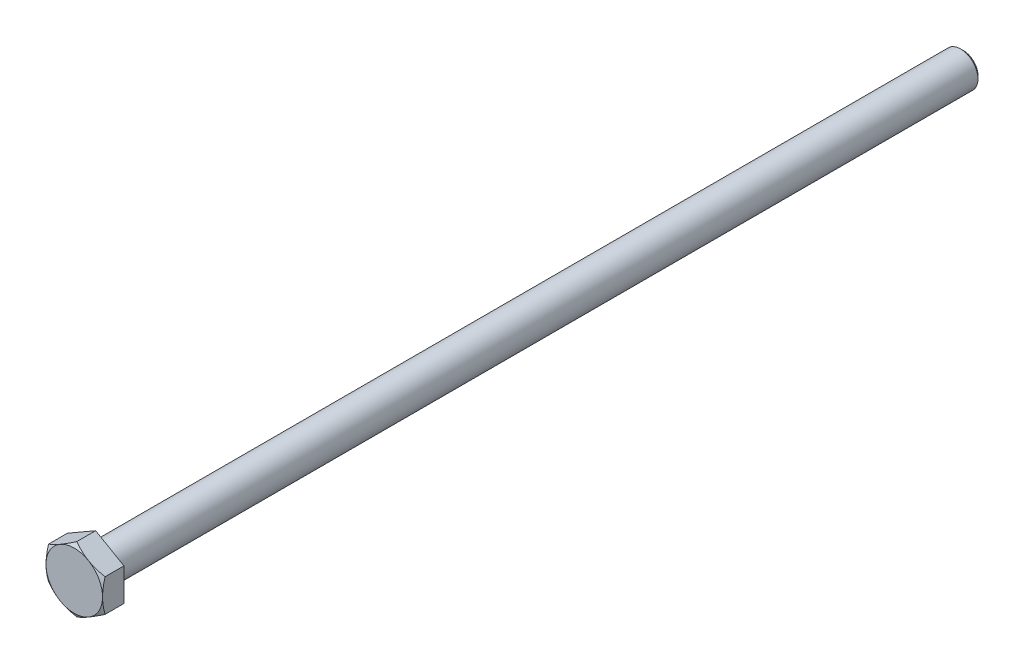
ISO-10303-21;
HEADER;
FILE_DESCRIPTION(('STEP AP214'),'2;1');
FILE_NAME('part.step','',(''),(''),'','','');
FILE_SCHEMA(('AUTOMOTIVE_DESIGN { 1 0 10303 214 1 1 1 1 }'));
ENDSEC;
DATA;
#1=APPLICATION_CONTEXT('core data for automotive mechanical design processes');
#2=APPLICATION_PROTOCOL_DEFINITION('international standard','automotive_design',2000,#1);
#3=PRODUCT_CONTEXT('',#1,'mechanical');
#4=PRODUCT('Part','Part','',(#3));
#5=PRODUCT_RELATED_PRODUCT_CATEGORY('part','',(#4));
#6=PRODUCT_DEFINITION_FORMATION('','',#4);
#7=PRODUCT_DEFINITION_CONTEXT('part definition',#1,'design');
#8=PRODUCT_DEFINITION('design','',#6,#7);
#9=PRODUCT_DEFINITION_SHAPE('','',#8);
#10=(LENGTH_UNIT() NAMED_UNIT(*) SI_UNIT(.MILLI.,.METRE.));
#11=(NAMED_UNIT(*) PLANE_ANGLE_UNIT() SI_UNIT($,.RADIAN.));
#12=(NAMED_UNIT(*) SI_UNIT($,.STERADIAN.) SOLID_ANGLE_UNIT());
#13=UNCERTAINTY_MEASURE_WITH_UNIT(LENGTH_MEASURE(1.E-05),#10,'distance_accuracy_value','');
#14=(GEOMETRIC_REPRESENTATION_CONTEXT(3) GLOBAL_UNCERTAINTY_ASSIGNED_CONTEXT((#13)) GLOBAL_UNIT_ASSIGNED_CONTEXT((#10,
#11,#12)) REPRESENTATION_CONTEXT('',''));
#15=CARTESIAN_POINT('',(0.,0.,0.));
#16=DIRECTION('',(0.,0.,1.));
#17=DIRECTION('',(1.,0.,0.));
#18=AXIS2_PLACEMENT_3D('',#15,#16,#17);
#19=CARTESIAN_POINT('',(0.,0.,0.));
#20=DIRECTION('',(0.,0.,1.));
#21=DIRECTION('',(1.,0.,0.));
#22=AXIS2_PLACEMENT_3D('',#19,#20,#21);
#23=PLANE('',#22);
#24=CARTESIAN_POINT('',(0.,0.,0.));
#25=DIRECTION('',(0.,0.,1.));
#26=DIRECTION('',(1.,0.,0.));
#27=AXIS2_PLACEMENT_3D('',#24,#25,#26);
#28=CIRCLE('',#27,3.25);
#29=CARTESIAN_POINT('',(3.25,0.,0.));
#30=VERTEX_POINT('',#29);
#31=EDGE_CURVE('E146',#30,#30,#28,.T.);
#32=ORIENTED_EDGE('',*,*,#31,.T.);
#33=EDGE_LOOP('',(#32));
#34=FACE_BOUND('',#33,.T.);
#35=CARTESIAN_POINT('',(0.,0.,0.));
#36=DIRECTION('',(0.,0.,1.));
#37=DIRECTION('',(1.,0.,0.));
#38=AXIS2_PLACEMENT_3D('',#35,#36,#37);
#39=CIRCLE('',#38,4.45);
#40=CARTESIAN_POINT('',(4.45,0.,0.));
#41=VERTEX_POINT('',#40);
#42=EDGE_CURVE('E292',#41,#41,#39,.T.);
#43=ORIENTED_EDGE('',*,*,#42,.F.);
#44=EDGE_LOOP('',(#43));
#45=FACE_BOUND('',#44,.T.);
#46=ADVANCED_FACE('F37',(#34,#45),#23,.F.);
#47=CARTESIAN_POINT('',(0.,0.,-0.25));
#48=DIRECTION('',(0.,0.,1.));
#49=DIRECTION('',(1.,0.,0.));
#50=AXIS2_PLACEMENT_3D('',#47,#48,#49);
#51=TOROIDAL_SURFACE('',#50,3.25,0.25);
#52=ORIENTED_EDGE('',*,*,#31,.F.);
#53=EDGE_LOOP('',(#52));
#54=FACE_BOUND('',#53,.T.);
#55=CARTESIAN_POINT('',(0.,0.,-0.25));
#56=DIRECTION('',(0.,0.,1.));
#57=DIRECTION('',(1.,0.,0.));
#58=AXIS2_PLACEMENT_3D('',#55,#56,#57);
#59=CIRCLE('',#58,3.);
#60=CARTESIAN_POINT('',(3.,0.,-0.25));
#61=VERTEX_POINT('',#60);
#62=EDGE_CURVE('E149',#61,#61,#59,.T.);
#63=ORIENTED_EDGE('',*,*,#62,.T.);
#64=EDGE_LOOP('',(#63));
#65=FACE_BOUND('',#64,.T.);
#66=ADVANCED_FACE('F233',(#54,#65),#51,.F.);
#67=CARTESIAN_POINT('',(0.,0.,0.));
#68=DIRECTION('',(0.,0.,1.));
#69=DIRECTION('',(1.,0.,0.));
#70=AXIS2_PLACEMENT_3D('',#67,#68,#69);
#71=CYLINDRICAL_SURFACE('',#70,3.00000000000001);
#72=ORIENTED_EDGE('',*,*,#62,.F.);
#73=EDGE_LOOP('',(#72));
#74=FACE_BOUND('',#73,.T.);
#75=CARTESIAN_POINT('',(0.,0.,-149.5));
#76=DIRECTION('',(0.,0.,1.));
#77=DIRECTION('',(1.,0.,0.));
#78=AXIS2_PLACEMENT_3D('',#75,#76,#77);
#79=CIRCLE('',#78,3.00000000000002);
#80=CARTESIAN_POINT('',(3.00000000000002,0.,-149.5));
#81=VERTEX_POINT('',#80);
#82=EDGE_CURVE('E152',#81,#81,#79,.T.);
#83=ORIENTED_EDGE('',*,*,#82,.T.);
#84=EDGE_LOOP('',(#83));
#85=FACE_BOUND('',#84,.T.);
#86=ADVANCED_FACE('F239',(#74,#85),#71,.T.);
#87=CARTESIAN_POINT('',(0.,0.,-150.));
#88=DIRECTION('',(0.,0.,1.));
#89=DIRECTION('',(1.,0.,0.));
#90=AXIS2_PLACEMENT_3D('',#87,#88,#89);
#91=CONICAL_SURFACE('',#90,2.5,0.785398163397497);
#92=ORIENTED_EDGE('',*,*,#82,.F.);
#93=EDGE_LOOP('',(#92));
#94=FACE_BOUND('',#93,.T.);
#95=CARTESIAN_POINT('',(0.,0.,-150.));
#96=DIRECTION('',(0.,0.,1.));
#97=DIRECTION('',(1.,0.,0.));
#98=AXIS2_PLACEMENT_3D('',#95,#96,#97);
#99=CIRCLE('',#98,2.5);
#100=CARTESIAN_POINT('',(2.5,0.,-150.));
#101=VERTEX_POINT('',#100);
#102=EDGE_CURVE('E125',#101,#101,#99,.T.);
#103=ORIENTED_EDGE('',*,*,#102,.T.);
#104=EDGE_LOOP('',(#103));
#105=FACE_BOUND('',#104,.T.);
#106=ADVANCED_FACE('F306',(#94,#105),#91,.T.);
#107=CARTESIAN_POINT('',(0.,2.5,-150.));
#108=DIRECTION('',(0.,0.,1.));
#109=DIRECTION('',(1.,0.,0.));
#110=AXIS2_PLACEMENT_3D('',#107,#108,#109);
#111=PLANE('',#110);
#112=ORIENTED_EDGE('',*,*,#102,.F.);
#113=EDGE_LOOP('',(#112));
#114=FACE_BOUND('',#113,.T.);
#115=ADVANCED_FACE('F302',(#114),#111,.F.);
#116=CARTESIAN_POINT('',(0.,5.64648563267455,0.149999999999995));
#117=DIRECTION('',(0.,0.,-1.));
#118=DIRECTION('',(-1.,0.,0.));
#119=AXIS2_PLACEMENT_3D('',#116,#117,#118);
#120=PLANE('',#119);
#121=CARTESIAN_POINT('',(0.,0.,0.149999999999996));
#122=DIRECTION('',(0.,0.,1.));
#123=DIRECTION('',(1.,0.,0.));
#124=AXIS2_PLACEMENT_3D('',#121,#122,#123);
#125=CIRCLE('',#124,4.53660254037844);
#126=CARTESIAN_POINT('',(4.53660254037844,0.,0.149999999999996));
#127=VERTEX_POINT('',#126);
#128=EDGE_CURVE('E289',#127,#127,#125,.T.);
#129=ORIENTED_EDGE('',*,*,#128,.T.);
#130=EDGE_LOOP('',(#129));
#131=FACE_BOUND('',#130,.T.);
#132=DIRECTION('',(0.866025403784439,-0.5,0.));
#133=VECTOR('',#132,1.);
#134=CARTESIAN_POINT('',(4.88999999999999,2.82324281633728,0.149999999999995));
#135=LINE('',#134,#133);
#136=CARTESIAN_POINT('',(0.,5.64648563267455,0.149999999999994));
#137=VERTEX_POINT('',#136);
#138=CARTESIAN_POINT('',(4.88999999999999,2.82324281633728,0.149999999999996));
#139=VERTEX_POINT('',#138);
#140=EDGE_CURVE('E60',#137,#139,#135,.T.);
#141=ORIENTED_EDGE('',*,*,#140,.T.);
#142=DIRECTION('',(0.,-1.,0.));
#143=VECTOR('',#142,1.);
#144=CARTESIAN_POINT('',(4.89,-2.82324281633726,0.149999999999995));
#145=LINE('',#144,#143);
#146=CARTESIAN_POINT('',(4.89,-2.8232428163373,0.149999999999994));
#147=VERTEX_POINT('',#146);
#148=EDGE_CURVE('E11',#139,#147,#145,.T.);
#149=ORIENTED_EDGE('',*,*,#148,.T.);
#150=DIRECTION('',(-0.866025403784439,-0.5,0.));
#151=VECTOR('',#150,1.);
#152=CARTESIAN_POINT('',(0.,-5.64648563267453,0.149999999999995));
#153=LINE('',#152,#151);
#154=CARTESIAN_POINT('',(0.,-5.64648563267455,0.149999999999994));
#155=VERTEX_POINT('',#154);
#156=EDGE_CURVE('E160',#147,#155,#153,.T.);
#157=ORIENTED_EDGE('',*,*,#156,.T.);
#158=DIRECTION('',(-0.866025403784438,0.500000000000001,0.));
#159=VECTOR('',#158,1.);
#160=CARTESIAN_POINT('',(-4.89000000000001,-2.82324281633725,0.149999999999995));
#161=LINE('',#160,#159);
#162=CARTESIAN_POINT('',(-4.89000000000003,-2.82324281633724,0.149999999999994));
#163=VERTEX_POINT('',#162);
#164=EDGE_CURVE('E158',#155,#163,#161,.T.);
#165=ORIENTED_EDGE('',*,*,#164,.T.);
#166=DIRECTION('',(0.,1.,0.));
#167=VECTOR('',#166,1.);
#168=CARTESIAN_POINT('',(-4.89000000000001,2.82324281633728,0.149999999999995));
#169=LINE('',#168,#167);
#170=CARTESIAN_POINT('',(-4.89000000000001,2.82324281633728,0.149999999999994));
#171=VERTEX_POINT('',#170);
#172=EDGE_CURVE('E111',#163,#171,#169,.T.);
#173=ORIENTED_EDGE('',*,*,#172,.T.);
#174=DIRECTION('',(0.866025403784438,0.500000000000001,0.));
#175=VECTOR('',#174,1.);
#176=CARTESIAN_POINT('',(0.,5.64648563267455,0.149999999999995));
#177=LINE('',#176,#175);
#178=EDGE_CURVE('E108',#171,#137,#177,.T.);
#179=ORIENTED_EDGE('',*,*,#178,.T.);
#180=EDGE_LOOP('',(#141,#149,#157,#165,#173,#179));
#181=FACE_BOUND('',#180,.T.);
#182=ADVANCED_FACE('F109',(#131,#181),#120,.T.);
#183=CARTESIAN_POINT('',(0.,0.,0.149999999999996));
#184=DIRECTION('',(0.,0.,1.));
#185=DIRECTION('',(1.,0.,0.));
#186=AXIS2_PLACEMENT_3D('',#183,#184,#185);
#187=CONICAL_SURFACE('',#186,4.53660254037844,0.523598775598282);
#188=ORIENTED_EDGE('',*,*,#42,.T.);
#189=EDGE_LOOP('',(#188));
#190=FACE_BOUND('',#189,.T.);
#191=ORIENTED_EDGE('',*,*,#128,.F.);
#192=EDGE_LOOP('',(#191));
#193=FACE_BOUND('',#192,.T.);
#194=ADVANCED_FACE('F184',(#190,#193),#187,.T.);
#195=CARTESIAN_POINT('',(4.89,-2.82324281633726,3.85));
#196=DIRECTION('',(-1.,0.,0.));
#197=DIRECTION('',(0.,-1.,0.));
#198=AXIS2_PLACEMENT_3D('',#195,#196,#197);
#199=PLANE('',#198);
#200=CARTESIAN_POINT('',(4.89000000000001,-7.48765775313645,1.51000356730942));
#201=CARTESIAN_POINT('',(4.89000000000001,-7.27295904195672,1.61375785164448));
#202=CARTESIAN_POINT('',(4.89,-7.05775271073168,1.71648073244178));
#203=CARTESIAN_POINT('',(4.89,-6.62605034199293,1.91927430832319));
#204=CARTESIAN_POINT('',(4.89,-6.40955408902474,2.01934454421085));
#205=CARTESIAN_POINT('',(4.89,-5.97382791496203,2.21677062729557));
#206=CARTESIAN_POINT('',(4.89,-5.75458944003077,2.31410766402508));
#207=CARTESIAN_POINT('',(4.89,-5.31431053040662,2.50460087346972));
#208=CARTESIAN_POINT('',(4.89,-5.09327019035303,2.59775726411412));
#209=CARTESIAN_POINT('',(4.89,-4.64629200879073,2.77988345385357));
#210=CARTESIAN_POINT('',(4.89,-4.42032735684764,2.86878781385642));
#211=CARTESIAN_POINT('',(4.89,-3.96573260766409,3.03963351585154));
#212=CARTESIAN_POINT('',(4.89,-3.7371022170828,3.12157408315784));
#213=CARTESIAN_POINT('',(4.89,-3.27728264689282,3.27629070652683));
#214=CARTESIAN_POINT('',(4.89,-3.04610008942787,3.34908624629718));
#215=CARTESIAN_POINT('',(4.89,-2.58044601766138,3.48314780313218));
#216=CARTESIAN_POINT('',(4.89,-2.34597556874296,3.54441746624459));
#217=CARTESIAN_POINT('',(4.89,-1.87359682509693,3.6524559509048));
#218=CARTESIAN_POINT('',(4.89,-1.63568763212012,3.69922090925989));
#219=CARTESIAN_POINT('',(4.89,-1.15696755556939,3.77508957337907));
#220=CARTESIAN_POINT('',(4.89,-0.916156669432105,3.80419326353987));
#221=CARTESIAN_POINT('',(4.89,-0.554557119059619,3.83273715490391));
#222=CARTESIAN_POINT('',(4.89,-0.434334477730913,3.83973462644426));
#223=CARTESIAN_POINT('',(4.89,-0.193695229375398,3.84863526238034));
#224=CARTESIAN_POINT('',(4.89,-0.0732786248877935,3.85053849293196));
#225=CARTESIAN_POINT('',(4.89,0.16749109253052,3.8491995215564));
#226=CARTESIAN_POINT('',(4.88999999999999,0.287844213794388,3.8459587650409));
#227=CARTESIAN_POINT('',(4.88999999999999,0.528309416646038,3.83441395112698));
#228=CARTESIAN_POINT('',(4.88999999999999,0.648421485761949,3.82610963819134));
#229=CARTESIAN_POINT('',(4.88999999999999,0.939547932186439,3.80001784499255));
#230=CARTESIAN_POINT('',(4.88999999999999,1.11033853773155,3.77969245042241));
#231=CARTESIAN_POINT('',(4.88999999999999,1.45058713974362,3.7299350000756));
#232=CARTESIAN_POINT('',(4.88999999999999,1.62004495541904,3.70050172994967));
#233=CARTESIAN_POINT('',(4.88999999999999,1.95752130363899,3.63356951616872));
#234=CARTESIAN_POINT('',(4.88999999999999,2.12553822381262,3.59606251993188));
#235=CARTESIAN_POINT('',(4.88999999999999,2.45984900568176,3.51412677475829));
#236=CARTESIAN_POINT('',(4.88999999999999,2.62614297162477,3.46969844723653));
#237=CARTESIAN_POINT('',(4.88999999999999,2.96109512240152,3.37382332945553));
#238=CARTESIAN_POINT('',(4.88999999999999,3.12971144094771,3.3222312786571));
#239=CARTESIAN_POINT('',(4.88999999999999,3.46516179969179,3.21394958759954));
#240=CARTESIAN_POINT('',(4.88999999999999,3.63199698161802,3.15726346335304));
#241=CARTESIAN_POINT('',(4.88999999999999,3.96321561788706,3.0399645325248));
#242=CARTESIAN_POINT('',(4.88999999999999,4.12760758653703,2.97937562388004));
#243=CARTESIAN_POINT('',(4.88999999999999,4.45511607041152,2.85464158482502));
#244=CARTESIAN_POINT('',(4.88999999999999,4.61823203931169,2.79049501711021));
#245=CARTESIAN_POINT('',(4.88999999999999,4.78075542610726,2.72492155094468));
#246=B_SPLINE_CURVE_WITH_KNOTS('',3,(#200,#201,#202,#203,#204,#205,#206,#207,#208,#209,#210,
#211,#212,#213,#214,#215,#216,#217,#218,#219,#220,#221,#222,#223,#224,#225,#226,#227,#228,#229,
#230,#231,#232,#233,#234,#235,#236,#237,#238,#239,#240,#241,#242,#243,#244,#245),.UNSPECIFIED.,
.F.,.F.,(4,2,2,2,2,2,2,2,2,2,2,2,2,2,2,2,2,2,2,2,2,2,4),(0.,0.7153727248842,1.43086848896917,
2.1504587475695,2.87001145159812,3.5983980303729,4.32686553261423,5.05375370190527,
5.7804115423284,6.5072627554185,7.23411461066235,7.59530124719655,7.95648319319179,
8.31756366844343,8.67866236747385,9.19436242057603,9.7101312613996,10.2264169237346,
10.7426711635666,11.2715711058286,11.8001087561781,12.3256714410849,12.8514480238299),.UNSPECIFIED.);
#247=CARTESIAN_POINT('',(4.89,-2.8232428163373,3.41324281633726));
#248=VERTEX_POINT('',#247);
#249=CARTESIAN_POINT('',(4.89,0.,3.85));
#250=VERTEX_POINT('',#249);
#251=EDGE_CURVE('E287',#248,#250,#246,.T.);
#252=ORIENTED_EDGE('',*,*,#251,.F.);
#253=DIRECTION('',(0.,0.,-1.));
#254=VECTOR('',#253,1.);
#255=CARTESIAN_POINT('',(4.89,-2.82324281633726,3.85));
#256=LINE('',#255,#254);
#257=EDGE_CURVE('E142',#248,#147,#256,.T.);
#258=ORIENTED_EDGE('',*,*,#257,.T.);
#259=ORIENTED_EDGE('',*,*,#148,.F.);
#260=DIRECTION('',(0.,0.,-1.));
#261=VECTOR('',#260,1.);
#262=CARTESIAN_POINT('',(4.88999999999999,2.82324281633728,3.85));
#263=LINE('',#262,#261);
#264=CARTESIAN_POINT('',(4.88999999999999,2.82324281633731,3.41324281633726));
#265=VERTEX_POINT('',#264);
#266=EDGE_CURVE('E124',#265,#139,#263,.T.);
#267=ORIENTED_EDGE('',*,*,#266,.F.);
#268=EDGE_CURVE('E189',#250,#265,#246,.T.);
#269=ORIENTED_EDGE('',*,*,#268,.F.);
#270=EDGE_LOOP('',(#252,#258,#259,#267,#269));
#271=FACE_BOUND('',#270,.T.);
#272=ADVANCED_FACE('F244',(#271),#199,.F.);
#273=CARTESIAN_POINT('',(0.,-5.64648563267453,3.85));
#274=DIRECTION('',(-0.5,0.866025403784439,0.));
#275=DIRECTION('',(-0.866025403784439,-0.5,0.));
#276=AXIS2_PLACEMENT_3D('',#273,#274,#275);
#277=PLANE('',#276);
#278=CARTESIAN_POINT('',(-0.000200000000002588,-5.64660110272837,3.41317614762566));
#279=CARTESIAN_POINT('',(0.214700507703036,-5.52252823675703,3.48482659057245));
#280=CARTESIAN_POINT('',(0.43143906459158,-5.39739417259366,3.54999598883395));
#281=CARTESIAN_POINT('',(0.868669193355439,-5.14495924005403,3.66374971401627));
#282=CARTESIAN_POINT('',(1.08916853360839,-5.01765388660286,3.71229380184742));
#283=CARTESIAN_POINT('',(1.5274681434467,-4.764601488877,3.78784655355306));
#284=CARTESIAN_POINT('',(1.74520015454811,-4.6388938536564,3.81535846158723));
#285=CARTESIAN_POINT('',(2.07256407642421,-4.44989020523826,3.8400291537318));
#286=CARTESIAN_POINT('',(2.1817600634462,-4.38684587273669,3.84548788786803));
#287=CARTESIAN_POINT('',(2.4002529538302,-4.26069894365747,3.85078020794518));
#288=CARTESIAN_POINT('',(2.50954985397084,-4.19759634893968,3.85061396763513));
#289=CARTESIAN_POINT('',(2.80899340260773,-4.02471253552707,3.8424171261738));
#290=CARTESIAN_POINT('',(2.99904083077676,-3.91498860171489,3.82865068559803));
#291=CARTESIAN_POINT('',(3.37787436079234,-3.69626896118234,3.78499711497161));
#292=CARTESIAN_POINT('',(3.56665913103152,-3.58727402326585,3.75509506240163));
#293=CARTESIAN_POINT('',(3.94625592990842,-3.36811370925075,3.68034757544745));
#294=CARTESIAN_POINT('',(4.13702005009145,-3.25797599311135,3.6351854074017));
#295=CARTESIAN_POINT('',(4.51570329947,-3.03934311714505,3.5326852438281));
#296=CARTESIAN_POINT('',(4.70362727913542,-2.93084515689803,3.47537132841));
#297=CARTESIAN_POINT('',(4.8902,-2.82312734628342,3.41317614762565));
#298=B_SPLINE_CURVE_WITH_KNOTS('',3,(#278,#279,#280,#281,#282,#283,#284,#285,#286,#287,#288,
#289,#290,#291,#292,#293,#294,#295,#296,#297),.UNSPECIFIED.,.F.,.F.,(4,2,2,2,2,2,2,2,2,4),(0.,
0.775119960737479,1.55210294061715,2.30985645656453,2.68836743942438,3.06686673052461,
3.72581548558265,4.38537469597493,5.05956292187759,5.73242744701956),.UNSPECIFIED.);
#299=CARTESIAN_POINT('',(0.,-5.64648563267455,3.41324281633726));
#300=VERTEX_POINT('',#299);
#301=CARTESIAN_POINT('',(2.445,-4.2348642245059,3.85));
#302=VERTEX_POINT('',#301);
#303=EDGE_CURVE('E258',#300,#302,#298,.T.);
#304=ORIENTED_EDGE('',*,*,#303,.F.);
#305=DIRECTION('',(0.,0.,-1.));
#306=VECTOR('',#305,1.);
#307=CARTESIAN_POINT('',(0.,-5.64648563267453,3.85));
#308=LINE('',#307,#306);
#309=EDGE_CURVE('E139',#300,#155,#308,.T.);
#310=ORIENTED_EDGE('',*,*,#309,.T.);
#311=ORIENTED_EDGE('',*,*,#156,.F.);
#312=ORIENTED_EDGE('',*,*,#257,.F.);
#313=EDGE_CURVE('E199',#302,#248,#298,.T.);
#314=ORIENTED_EDGE('',*,*,#313,.F.);
#315=EDGE_LOOP('',(#304,#310,#311,#312,#314));
#316=FACE_BOUND('',#315,.T.);
#317=ADVANCED_FACE('F247',(#316),#277,.F.);
#318=CARTESIAN_POINT('',(-4.89000000000001,-2.82324281633725,3.85));
#319=DIRECTION('',(0.500000000000001,0.866025403784438,0.));
#320=DIRECTION('',(-0.866025403784438,0.500000000000001,0.));
#321=AXIS2_PLACEMENT_3D('',#318,#319,#320);
#322=PLANE('',#321);
#323=CARTESIAN_POINT('',(-4.89020000000001,-2.82312734628342,3.41317614762565));
#324=CARTESIAN_POINT('',(-4.67529949229697,-2.94720021225475,3.48482659057245));
#325=CARTESIAN_POINT('',(-4.45856093540842,-3.07233427641813,3.54999598883395));
#326=CARTESIAN_POINT('',(-4.02133080664456,-3.32476920895775,3.66374971401626));
#327=CARTESIAN_POINT('',(-3.80083146639161,-3.45207456240893,3.71229380184742));
#328=CARTESIAN_POINT('',(-3.3625318565533,-3.70512696013479,3.78784655355306));
#329=CARTESIAN_POINT('',(-3.14479984545189,-3.83083459535539,3.81535846158723));
#330=CARTESIAN_POINT('',(-2.81743592357579,-4.01983824377352,3.8400291537318));
#331=CARTESIAN_POINT('',(-2.7082399365538,-4.0828825762751,3.84548788786802));
#332=CARTESIAN_POINT('',(-2.4897470461698,-4.20902950535432,3.85078020794518));
#333=CARTESIAN_POINT('',(-2.38045014602916,-4.27213210007211,3.85061396763513));
#334=CARTESIAN_POINT('',(-2.08100659739227,-4.44501591348472,3.8424171261738));
#335=CARTESIAN_POINT('',(-1.89095916922324,-4.5547398472969,3.82865068559803));
#336=CARTESIAN_POINT('',(-1.51212563920766,-4.77345948782945,3.78499711497161));
#337=CARTESIAN_POINT('',(-1.32334086896848,-4.88245442574594,3.75509506240163));
#338=CARTESIAN_POINT('',(-0.943744070091587,-5.10161473976104,3.68034757544745));
#339=CARTESIAN_POINT('',(-0.752979949908555,-5.21175245590044,3.6351854074017));
#340=CARTESIAN_POINT('',(-0.374296700530004,-5.43038533186675,3.5326852438281));
#341=CARTESIAN_POINT('',(-0.186372720864583,-5.53888329211376,3.47537132841));
#342=CARTESIAN_POINT('',(0.000199999999997466,-5.64660110272837,3.41317614762566));
#343=B_SPLINE_CURVE_WITH_KNOTS('',3,(#323,#324,#325,#326,#327,#328,#329,#330,#331,#332,#333,
#334,#335,#336,#337,#338,#339,#340,#341,#342),.UNSPECIFIED.,.F.,.F.,(4,2,2,2,2,2,2,2,2,4),(0.,
0.77511996073748,1.55210294061715,2.30985645656453,2.68836743942439,3.06686673052461,
3.72581548558265,4.38537469597494,5.0595629218776,5.73242744701957),.UNSPECIFIED.);
#344=CARTESIAN_POINT('',(-4.89000000000003,-2.82324281633724,3.41324281633726));
#345=VERTEX_POINT('',#344);
#346=CARTESIAN_POINT('',(-2.445,-4.2348642245059,3.85));
#347=VERTEX_POINT('',#346);
#348=EDGE_CURVE('E220',#345,#347,#343,.T.);
#349=ORIENTED_EDGE('',*,*,#348,.F.);
#350=DIRECTION('',(0.,0.,-1.));
#351=VECTOR('',#350,1.);
#352=CARTESIAN_POINT('',(-4.89000000000001,-2.82324281633725,3.85));
#353=LINE('',#352,#351);
#354=EDGE_CURVE('E134',#345,#163,#353,.T.);
#355=ORIENTED_EDGE('',*,*,#354,.T.);
#356=ORIENTED_EDGE('',*,*,#164,.F.);
#357=ORIENTED_EDGE('',*,*,#309,.F.);
#358=EDGE_CURVE('E207',#347,#300,#343,.T.);
#359=ORIENTED_EDGE('',*,*,#358,.F.);
#360=EDGE_LOOP('',(#349,#355,#356,#357,#359));
#361=FACE_BOUND('',#360,.T.);
#362=ADVANCED_FACE('F224',(#361),#322,.F.);
#363=CARTESIAN_POINT('',(-4.89000000000001,2.82324281633728,3.85));
#364=DIRECTION('',(1.,0.,0.));
#365=DIRECTION('',(0.,0.,-1.));
#366=AXIS2_PLACEMENT_3D('',#363,#364,#365);
#367=PLANE('',#366);
#368=CARTESIAN_POINT('',(-4.89000000000001,-7.48765600772476,1.51000441103331));
#369=CARTESIAN_POINT('',(-4.89000000000001,-7.27295735629361,1.6137586592677));
#370=CARTESIAN_POINT('',(-4.89000000000001,-7.05775108486279,1.71648150398559));
#371=CARTESIAN_POINT('',(-4.89000000000001,-6.62604883591243,1.91927500790031));
#372=CARTESIAN_POINT('',(-4.89000000000001,-6.40955264293844,2.01934520790071));
#373=CARTESIAN_POINT('',(-4.89000000000001,-5.97382658986727,2.21677121919285));
#374=CARTESIAN_POINT('',(-4.89000000000001,-5.75458817593758,2.31410822002467));
#375=CARTESIAN_POINT('',(-4.89000000000001,-5.31430938877032,2.50460135833449));
#376=CARTESIAN_POINT('',(-4.89000000000001,-5.09326911017202,2.5977577137417));
#377=CARTESIAN_POINT('',(-4.89000000000001,-4.64629105317533,2.77988383361275));
#378=CARTESIAN_POINT('',(-4.89000000000001,-4.42032646435314,2.86878815900327));
#379=CARTESIAN_POINT('',(-4.89000000000001,-3.96573184246812,3.03963379369343));
#380=CARTESIAN_POINT('',(-4.89000000000001,-3.73710151606474,3.12157432830779));
#381=CARTESIAN_POINT('',(-4.89000000000001,-3.27728207544226,3.2762908895474));
#382=CARTESIAN_POINT('',(-4.89000000000001,-3.04609958336246,3.34908639986968));
#383=CARTESIAN_POINT('',(-4.89000000000001,-2.58044564416881,3.48314790279281));
#384=CARTESIAN_POINT('',(-4.89000000000001,-2.34597526243701,3.54441754143818));
#385=CARTESIAN_POINT('',(-4.89000000000001,-1.87359669032776,3.65245597659302));
#386=CARTESIAN_POINT('',(-4.89000000000001,-1.63568760220248,3.69922091206565));
#387=CARTESIAN_POINT('',(-4.89000000000001,-1.15696773775512,3.77508954643503));
#388=CARTESIAN_POINT('',(-4.89000000000001,-0.916156958867771,3.80419322971701));
#389=CARTESIAN_POINT('',(-4.89000000000001,-0.554557569178705,3.8327371248486));
#390=CARTESIAN_POINT('',(-4.89000000000001,-0.434334981110034,3.83973459995937));
#391=CARTESIAN_POINT('',(-4.89000000000001,-0.193695839123298,3.84863524768087));
#392=CARTESIAN_POINT('',(-4.89000000000001,-0.0732792877444449,3.85053848644754));
#393=CARTESIAN_POINT('',(-4.89000000000001,0.167490323894741,3.84919953600194));
#394=CARTESIAN_POINT('',(-4.89000000000001,0.287843392488112,3.84595879220187));
#395=CARTESIAN_POINT('',(-4.89000000000001,0.528308490711507,3.83441400785745));
#396=CARTESIAN_POINT('',(-4.89000000000001,0.648420507869707,3.82610971177637));
#397=CARTESIAN_POINT('',(-4.89000000000001,0.93954687167829,3.80001796009075));
#398=CARTESIAN_POINT('',(-4.89000000000001,1.11033744681783,3.77969258959107));
#399=CARTESIAN_POINT('',(-4.89000000000001,1.45058598931804,3.7299351887032));
#400=CARTESIAN_POINT('',(-4.89000000000001,1.62004377588731,3.70050194396574));
#401=CARTESIAN_POINT('',(-4.89000000000001,1.9575200668541,3.63356978141269));
#402=CARTESIAN_POINT('',(-4.89000000000001,2.12553695888227,3.59606281101829));
#403=CARTESIAN_POINT('',(-4.89000000000001,2.45984768520193,3.51412711733345));
#404=CARTESIAN_POINT('',(-4.89000000000001,2.62614162374088,3.46969881545809));
#405=CARTESIAN_POINT('',(-4.89000000000001,2.96109371912458,3.37382374915089));
#406=CARTESIAN_POINT('',(-4.89000000000001,3.12971000969737,3.32223172418017));
#407=CARTESIAN_POINT('',(-4.89000000000001,3.46516031280715,3.21395008401802));
#408=CARTESIAN_POINT('',(-4.89000000000001,3.63199546707202,3.15726398483887));
#409=CARTESIAN_POINT('',(-4.89000000000001,3.9632140484208,3.03996510316754));
#410=CARTESIAN_POINT('',(-4.89000000000001,4.12760598980996,2.979376218613));
#411=CARTESIAN_POINT('',(-4.89000000000001,4.45511441910326,2.8546422270129));
#412=CARTESIAN_POINT('',(-4.89000000000001,4.61823036068345,2.79049568266354));
#413=CARTESIAN_POINT('',(-4.89000000000001,4.78075372011223,2.72492223950264));
#414=B_SPLINE_CURVE_WITH_KNOTS('',3,(#368,#369,#370,#371,#372,#373,#374,#375,#376,#377,#378,
#379,#380,#381,#382,#383,#384,#385,#386,#387,#388,#389,#390,#391,#392,#393,#394,#395,#396,#397,
#398,#399,#400,#401,#402,#403,#404,#405,#406,#407,#408,#409,#410,#411,#412,#413),.UNSPECIFIED.,
.F.,.F.,(4,2,2,2,2,2,2,2,2,2,2,2,2,2,2,2,2,2,2,2,2,2,4),(0.,0.715372516370715,1.43086807190761,
2.15045811954722,2.87001061263201,3.59839697719427,4.32686426515068,5.05375222092806,
5.78040984801074,6.50726073990441,7.23411227442469,7.59529875220077,7.95648053943226,
8.31756085583944,8.67865939599887,9.19435935004834,9.71012809181595,10.2264136548301,
10.7426677953428,11.2715676346498,11.8001051822006,12.325667765354,12.8514442461445),.UNSPECIFIED.);
#415=CARTESIAN_POINT('',(-4.89000000000001,2.82324281633728,3.41324281633726));
#416=VERTEX_POINT('',#415);
#417=CARTESIAN_POINT('',(-4.89,0.,3.85));
#418=VERTEX_POINT('',#417);
#419=EDGE_CURVE('E219',#416,#418,#414,.F.);
#420=ORIENTED_EDGE('',*,*,#419,.F.);
#421=DIRECTION('',(0.,0.,-1.));
#422=VECTOR('',#421,1.);
#423=CARTESIAN_POINT('',(-4.89000000000001,2.82324281633728,3.85));
#424=LINE('',#423,#422);
#425=EDGE_CURVE('E131',#416,#171,#424,.T.);
#426=ORIENTED_EDGE('',*,*,#425,.T.);
#427=ORIENTED_EDGE('',*,*,#172,.F.);
#428=ORIENTED_EDGE('',*,*,#354,.F.);
#429=EDGE_CURVE('E213',#418,#345,#414,.F.);
#430=ORIENTED_EDGE('',*,*,#429,.F.);
#431=EDGE_LOOP('',(#420,#426,#427,#428,#430));
#432=FACE_BOUND('',#431,.T.);
#433=ADVANCED_FACE('F221',(#432),#367,.F.);
#434=CARTESIAN_POINT('',(0.,5.64648563267455,3.85));
#435=DIRECTION('',(0.500000000000001,-0.866025403784438,0.));
#436=DIRECTION('',(0.866025403784438,0.500000000000001,0.));
#437=AXIS2_PLACEMENT_3D('',#434,#435,#436);
#438=PLANE('',#437);
#439=CARTESIAN_POINT('',(0.000199999999993516,5.64660110272839,3.41317614762564));
#440=CARTESIAN_POINT('',(-0.214700507703046,5.52252823675705,3.48482659057244));
#441=CARTESIAN_POINT('',(-0.431439064591591,5.39739417259368,3.54999598883394));
#442=CARTESIAN_POINT('',(-0.868669193355451,5.14495924005405,3.66374971401626));
#443=CARTESIAN_POINT('',(-1.0891685336084,5.01765388660287,3.71229380184741));
#444=CARTESIAN_POINT('',(-1.52746814344671,4.76460148887702,3.78784655355305));
#445=CARTESIAN_POINT('',(-1.74520015454812,4.63889385365642,3.81535846158722));
#446=CARTESIAN_POINT('',(-2.07256407642423,4.44989020523828,3.84002915373179));
#447=CARTESIAN_POINT('',(-2.18176006344621,4.38684587273671,3.84548788786801));
#448=CARTESIAN_POINT('',(-2.40025295383022,4.26069894365748,3.85078020794517));
#449=CARTESIAN_POINT('',(-2.50954985397086,4.19759634893969,3.85061396763512));
#450=CARTESIAN_POINT('',(-2.80899340260775,4.02471253552709,3.84241712617379));
#451=CARTESIAN_POINT('',(-2.99904083077677,3.9149886017149,3.82865068559802));
#452=CARTESIAN_POINT('',(-3.37787436079236,3.69626896118235,3.7849971149716));
#453=CARTESIAN_POINT('',(-3.56665913103153,3.58727402326586,3.75509506240161));
#454=CARTESIAN_POINT('',(-3.94625592990843,3.36811370925076,3.68034757544744));
#455=CARTESIAN_POINT('',(-4.13702005009146,3.25797599311137,3.63518540740169));
#456=CARTESIAN_POINT('',(-4.51570329947001,3.03934311714506,3.53268524382809));
#457=CARTESIAN_POINT('',(-4.70362727913543,2.93084515689804,3.47537132840999));
#458=CARTESIAN_POINT('',(-4.89020000000001,2.82312734628344,3.41317614762565));
#459=B_SPLINE_CURVE_WITH_KNOTS('',3,(#439,#440,#441,#442,#443,#444,#445,#446,#447,#448,#449,
#450,#451,#452,#453,#454,#455,#456,#457,#458),.UNSPECIFIED.,.F.,.F.,(4,2,2,2,2,2,2,2,2,4),(0.,
0.775119960737483,1.55210294061715,2.30985645656454,2.68836743942439,3.06686673052462,
3.72581548558266,4.38537469597494,5.0595629218776,5.73242744701956),.UNSPECIFIED.);
#460=CARTESIAN_POINT('',(0.,5.64648563267455,3.41324281633726));
#461=VERTEX_POINT('',#460);
#462=CARTESIAN_POINT('',(-2.445,4.2348642245059,3.85));
#463=VERTEX_POINT('',#462);
#464=EDGE_CURVE('E130',#461,#463,#459,.T.);
#465=ORIENTED_EDGE('',*,*,#464,.F.);
#466=DIRECTION('',(0.,0.,-1.));
#467=VECTOR('',#466,1.);
#468=CARTESIAN_POINT('',(0.,5.64648563267455,3.85));
#469=LINE('',#468,#467);
#470=EDGE_CURVE('E122',#461,#137,#469,.T.);
#471=ORIENTED_EDGE('',*,*,#470,.T.);
#472=ORIENTED_EDGE('',*,*,#178,.F.);
#473=ORIENTED_EDGE('',*,*,#425,.F.);
#474=EDGE_CURVE('E170',#463,#416,#459,.T.);
#475=ORIENTED_EDGE('',*,*,#474,.F.);
#476=EDGE_LOOP('',(#465,#471,#472,#473,#475));
#477=FACE_BOUND('',#476,.T.);
#478=ADVANCED_FACE('F128',(#477),#438,.F.);
#479=CARTESIAN_POINT('',(4.88999999999999,2.82324281633728,3.85));
#480=DIRECTION('',(-0.5,-0.866025403784439,0.));
#481=DIRECTION('',(0.866025403784439,-0.5,0.));
#482=AXIS2_PLACEMENT_3D('',#479,#480,#481);
#483=PLANE('',#482);
#484=CARTESIAN_POINT('',(4.89019999999999,2.82312734628344,3.41317614762565));
#485=CARTESIAN_POINT('',(4.67529949229695,2.94720021225478,3.48482659057245));
#486=CARTESIAN_POINT('',(4.45856093540841,3.07233427641815,3.54999598883394));
#487=CARTESIAN_POINT('',(4.02133080664455,3.32476920895778,3.66374971401626));
#488=CARTESIAN_POINT('',(3.8008314663916,3.45207456240896,3.71229380184741));
#489=CARTESIAN_POINT('',(3.36253185655329,3.70512696013482,3.78784655355306));
#490=CARTESIAN_POINT('',(3.14479984545188,3.83083459535541,3.81535846158722));
#491=CARTESIAN_POINT('',(2.81743592357577,4.01983824377355,3.84002915373179));
#492=CARTESIAN_POINT('',(2.70823993655379,4.08288257627512,3.84548788786802));
#493=CARTESIAN_POINT('',(2.48974704616978,4.20902950535435,3.85078020794518));
#494=CARTESIAN_POINT('',(2.38045014602914,4.27213210007214,3.85061396763512));
#495=CARTESIAN_POINT('',(2.08100659739225,4.44501591348474,3.84241712617379));
#496=CARTESIAN_POINT('',(1.89095916922323,4.55473984729693,3.82865068559802));
#497=CARTESIAN_POINT('',(1.51212563920764,4.77345948782948,3.7849971149716));
#498=CARTESIAN_POINT('',(1.32334086896847,4.88245442574597,3.75509506240161));
#499=CARTESIAN_POINT('',(0.943744070091573,5.10161473976106,3.68034757544744));
#500=CARTESIAN_POINT('',(0.752979949908542,5.21175245590046,3.63518540740169));
#501=CARTESIAN_POINT('',(0.374296700529993,5.43038533186677,3.53268524382809));
#502=CARTESIAN_POINT('',(0.186372720864573,5.53888329211378,3.47537132840999));
#503=CARTESIAN_POINT('',(-0.00020000000000662,5.64660110272839,3.41317614762564));
#504=B_SPLINE_CURVE_WITH_KNOTS('',3,(#484,#485,#486,#487,#488,#489,#490,#491,#492,#493,#494,
#495,#496,#497,#498,#499,#500,#501,#502,#503),.UNSPECIFIED.,.F.,.F.,(4,2,2,2,2,2,2,2,2,4),(0.,
0.775119960737481,1.55210294061715,2.30985645656453,2.68836743942439,3.06686673052462,
3.72581548558265,4.38537469597494,5.05956292187759,5.73242744701956),.UNSPECIFIED.);
#505=CARTESIAN_POINT('',(2.445,4.2348642245059,3.85));
#506=VERTEX_POINT('',#505);
#507=EDGE_CURVE('E162',#265,#506,#504,.T.);
#508=ORIENTED_EDGE('',*,*,#507,.F.);
#509=ORIENTED_EDGE('',*,*,#266,.T.);
#510=ORIENTED_EDGE('',*,*,#140,.F.);
#511=ORIENTED_EDGE('',*,*,#470,.F.);
#512=EDGE_CURVE('E163',#506,#461,#504,.T.);
#513=ORIENTED_EDGE('',*,*,#512,.F.);
#514=EDGE_LOOP('',(#508,#509,#510,#511,#513));
#515=FACE_BOUND('',#514,.T.);
#516=ADVANCED_FACE('F39',(#515),#483,.F.);
#517=CARTESIAN_POINT('',(0.,0.,3.85));
#518=DIRECTION('',(0.,0.,-1.));
#519=DIRECTION('',(-1.,0.,0.));
#520=AXIS2_PLACEMENT_3D('',#517,#518,#519);
#521=CONICAL_SURFACE('',#520,4.89,1.04719755119659);
#522=ORIENTED_EDGE('',*,*,#313,.T.);
#523=ORIENTED_EDGE('',*,*,#251,.T.);
#524=CARTESIAN_POINT('',(0.,0.,3.85));
#525=DIRECTION('',(0.,0.,1.));
#526=DIRECTION('',(1.,0.,0.));
#527=AXIS2_PLACEMENT_3D('',#524,#525,#526);
#528=CIRCLE('',#527,4.89);
#529=EDGE_CURVE('E53',#302,#250,#528,.T.);
#530=ORIENTED_EDGE('',*,*,#529,.F.);
#531=EDGE_LOOP('',(#522,#523,#530));
#532=FACE_BOUND('',#531,.T.);
#533=ADVANCED_FACE('F183',(#532),#521,.T.);
#534=ORIENTED_EDGE('',*,*,#358,.T.);
#535=ORIENTED_EDGE('',*,*,#303,.T.);
#536=EDGE_CURVE('E133',#347,#302,#528,.T.);
#537=ORIENTED_EDGE('',*,*,#536,.F.);
#538=EDGE_LOOP('',(#534,#535,#537));
#539=FACE_BOUND('',#538,.T.);
#540=ADVANCED_FACE('F390',(#539),#521,.T.);
#541=ORIENTED_EDGE('',*,*,#429,.T.);
#542=ORIENTED_EDGE('',*,*,#348,.T.);
#543=EDGE_CURVE('E279',#418,#347,#528,.T.);
#544=ORIENTED_EDGE('',*,*,#543,.F.);
#545=EDGE_LOOP('',(#541,#542,#544));
#546=FACE_BOUND('',#545,.T.);
#547=ADVANCED_FACE('F280',(#546),#521,.T.);
#548=ORIENTED_EDGE('',*,*,#474,.T.);
#549=ORIENTED_EDGE('',*,*,#419,.T.);
#550=EDGE_CURVE('E275',#463,#418,#528,.T.);
#551=ORIENTED_EDGE('',*,*,#550,.F.);
#552=EDGE_LOOP('',(#548,#549,#551));
#553=FACE_BOUND('',#552,.T.);
#554=ADVANCED_FACE('F273',(#553),#521,.T.);
#555=ORIENTED_EDGE('',*,*,#512,.T.);
#556=ORIENTED_EDGE('',*,*,#464,.T.);
#557=EDGE_CURVE('E46',#506,#463,#528,.T.);
#558=ORIENTED_EDGE('',*,*,#557,.F.);
#559=EDGE_LOOP('',(#555,#556,#558));
#560=FACE_BOUND('',#559,.T.);
#561=ADVANCED_FACE('F181',(#560),#521,.T.);
#562=ORIENTED_EDGE('',*,*,#507,.T.);
#563=CARTESIAN_POINT('',(0.,0.,3.85));
#564=DIRECTION('',(0.,0.,1.));
#565=DIRECTION('',(1.,0.,0.));
#566=AXIS2_PLACEMENT_3D('',#563,#564,#565);
#567=CIRCLE('',#566,4.89);
#568=EDGE_CURVE('E283',#250,#506,#567,.T.);
#569=ORIENTED_EDGE('',*,*,#568,.F.);
#570=ORIENTED_EDGE('',*,*,#268,.T.);
#571=EDGE_LOOP('',(#562,#569,#570));
#572=FACE_BOUND('',#571,.T.);
#573=ADVANCED_FACE('F176',(#572),#521,.T.);
#574=CARTESIAN_POINT('',(0.,0.,3.85));
#575=DIRECTION('',(0.,0.,1.));
#576=DIRECTION('',(1.,0.,0.));
#577=AXIS2_PLACEMENT_3D('',#574,#575,#576);
#578=PLANE('',#577);
#579=ORIENTED_EDGE('',*,*,#529,.T.);
#580=ORIENTED_EDGE('',*,*,#568,.T.);
#581=ORIENTED_EDGE('',*,*,#557,.T.);
#582=ORIENTED_EDGE('',*,*,#550,.T.);
#583=ORIENTED_EDGE('',*,*,#543,.T.);
#584=ORIENTED_EDGE('',*,*,#536,.T.);
#585=EDGE_LOOP('',(#579,#580,#581,#582,#583,#584));
#586=FACE_BOUND('',#585,.T.);
#587=ADVANCED_FACE('F180',(#586),#578,.T.);
#588=CLOSED_SHELL('',(#46,#66,#86,#106,#115,#182,#194,#272,#317,#362,#433,#478,#516,#533,#540,
#547,#554,#561,#573,#587));
#589=MANIFOLD_SOLID_BREP('B2',#588);
#590=ADVANCED_BREP_SHAPE_REPRESENTATION('',(#18,#589),#14);
#591=SHAPE_DEFINITION_REPRESENTATION(#9,#590);
ENDSEC;
END-ISO-10303-21;
